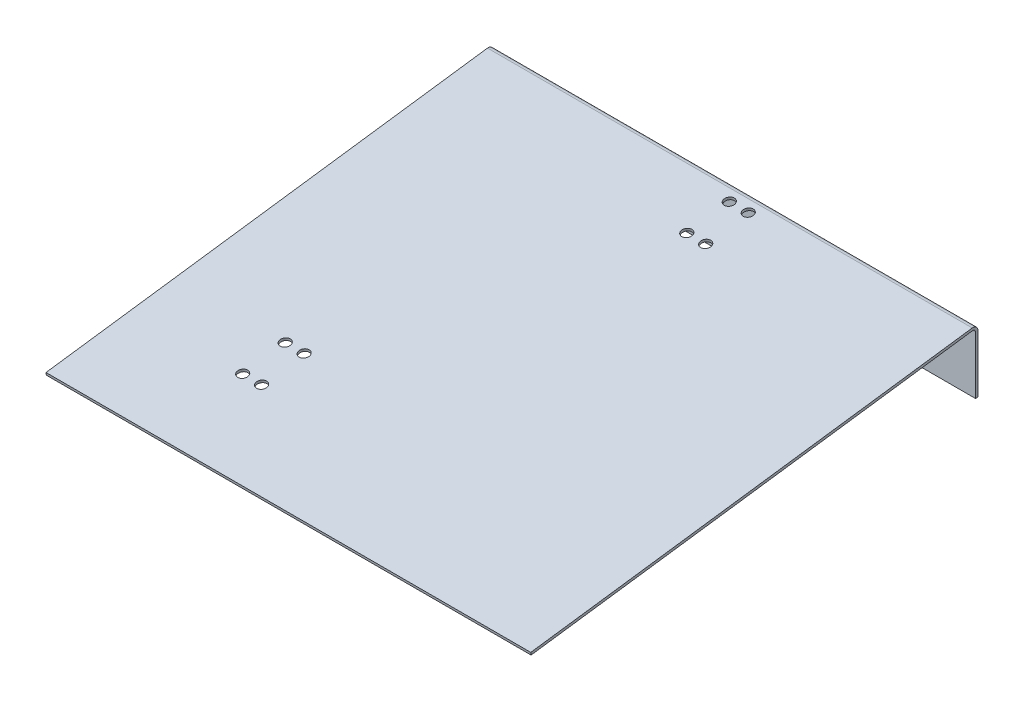
ISO-10303-21;
HEADER;
FILE_DESCRIPTION(('STEP AP214'),'2;1');
FILE_NAME('part.step','',(''),(''),'','','');
FILE_SCHEMA(('AUTOMOTIVE_DESIGN { 1 0 10303 214 1 1 1 1 }'));
ENDSEC;
DATA;
#1=APPLICATION_CONTEXT('core data for automotive mechanical design processes');
#2=APPLICATION_PROTOCOL_DEFINITION('international standard','automotive_design',2000,#1);
#3=PRODUCT_CONTEXT('',#1,'mechanical');
#4=PRODUCT('Part','Part','',(#3));
#5=PRODUCT_RELATED_PRODUCT_CATEGORY('part','',(#4));
#6=PRODUCT_DEFINITION_FORMATION('','',#4);
#7=PRODUCT_DEFINITION_CONTEXT('part definition',#1,'design');
#8=PRODUCT_DEFINITION('design','',#6,#7);
#9=PRODUCT_DEFINITION_SHAPE('','',#8);
#10=(LENGTH_UNIT() NAMED_UNIT(*) SI_UNIT(.MILLI.,.METRE.));
#11=(NAMED_UNIT(*) PLANE_ANGLE_UNIT() SI_UNIT($,.RADIAN.));
#12=(NAMED_UNIT(*) SI_UNIT($,.STERADIAN.) SOLID_ANGLE_UNIT());
#13=UNCERTAINTY_MEASURE_WITH_UNIT(LENGTH_MEASURE(1.E-05),#10,'distance_accuracy_value','');
#14=(GEOMETRIC_REPRESENTATION_CONTEXT(3) GLOBAL_UNCERTAINTY_ASSIGNED_CONTEXT((#13)) GLOBAL_UNIT_ASSIGNED_CONTEXT((#10,
#11,#12)) REPRESENTATION_CONTEXT('',''));
#15=CARTESIAN_POINT('',(0.,0.,0.));
#16=DIRECTION('',(0.,0.,1.));
#17=DIRECTION('',(1.,0.,0.));
#18=AXIS2_PLACEMENT_3D('',#15,#16,#17);
#19=CARTESIAN_POINT('',(304.8,76.2,-282.575));
#20=DIRECTION('',(0.,0.,1.));
#21=DIRECTION('',(1.,0.,0.));
#22=AXIS2_PLACEMENT_3D('',#19,#20,#21);
#23=PLANE('',#22);
#24=DIRECTION('',(0.,1.,0.));
#25=VECTOR('',#24,1.);
#26=CARTESIAN_POINT('',(-304.8,39.009334551279,-282.575));
#27=LINE('',#26,#25);
#28=CARTESIAN_POINT('',(-304.8,72.5626617948586,-282.575));
#29=VERTEX_POINT('',#28);
#30=CARTESIAN_POINT('',(-304.8,0.,-282.575));
#31=VERTEX_POINT('',#30);
#32=EDGE_CURVE('E63',#29,#31,#27,.F.);
#33=ORIENTED_EDGE('',*,*,#32,.F.);
#34=DIRECTION('',(1.,0.,0.));
#35=VECTOR('',#34,1.);
#36=CARTESIAN_POINT('',(304.8,72.5626617948586,-282.575));
#37=LINE('',#36,#35);
#38=CARTESIAN_POINT('',(304.8,72.5626617948586,-282.575));
#39=VERTEX_POINT('',#38);
#40=EDGE_CURVE('E84',#39,#29,#37,.F.);
#41=ORIENTED_EDGE('',*,*,#40,.F.);
#42=DIRECTION('',(0.,1.,0.));
#43=VECTOR('',#42,1.);
#44=CARTESIAN_POINT('',(304.8,39.009334551279,-282.575));
#45=LINE('',#44,#43);
#46=CARTESIAN_POINT('',(304.8,0.,-282.575));
#47=VERTEX_POINT('',#46);
#48=EDGE_CURVE('E83',#39,#47,#45,.F.);
#49=ORIENTED_EDGE('',*,*,#48,.T.);
#50=DIRECTION('',(1.,0.,0.));
#51=VECTOR('',#50,1.);
#52=CARTESIAN_POINT('',(0.,0.,-282.575));
#53=LINE('',#52,#51);
#54=EDGE_CURVE('E80',#47,#31,#53,.F.);
#55=ORIENTED_EDGE('',*,*,#54,.T.);
#56=EDGE_LOOP('',(#33,#41,#49,#55));
#57=FACE_BOUND('',#56,.T.);
#58=ADVANCED_FACE('F17',(#57),#23,.F.);
#59=CARTESIAN_POINT('',(0.,0.,-280.9875));
#60=DIRECTION('',(0.,1.,0.));
#61=DIRECTION('',(0.,0.,1.));
#62=AXIS2_PLACEMENT_3D('',#59,#60,#61);
#63=PLANE('',#62);
#64=ORIENTED_EDGE('',*,*,#54,.F.);
#65=DIRECTION('',(0.,0.,1.));
#66=VECTOR('',#65,1.);
#67=CARTESIAN_POINT('',(304.8,0.,-280.9875));
#68=LINE('',#67,#66);
#69=CARTESIAN_POINT('',(304.8,0.,-279.4));
#70=VERTEX_POINT('',#69);
#71=EDGE_CURVE('E72',#47,#70,#68,.T.);
#72=ORIENTED_EDGE('',*,*,#71,.T.);
#73=DIRECTION('',(1.,0.,0.));
#74=VECTOR('',#73,1.);
#75=CARTESIAN_POINT('',(304.8,0.,-279.4));
#76=LINE('',#75,#74);
#77=CARTESIAN_POINT('',(-304.8,0.,-279.4));
#78=VERTEX_POINT('',#77);
#79=EDGE_CURVE('E105',#78,#70,#76,.T.);
#80=ORIENTED_EDGE('',*,*,#79,.F.);
#81=DIRECTION('',(0.,0.,1.));
#82=VECTOR('',#81,1.);
#83=CARTESIAN_POINT('',(-304.8,0.,-280.9875));
#84=LINE('',#83,#82);
#85=EDGE_CURVE('E88',#31,#78,#84,.T.);
#86=ORIENTED_EDGE('',*,*,#85,.F.);
#87=EDGE_LOOP('',(#64,#72,#80,#86));
#88=FACE_BOUND('',#87,.T.);
#89=ADVANCED_FACE('F90',(#88),#63,.F.);
#90=CARTESIAN_POINT('',(304.8,72.5626617948586,-276.225));
#91=DIRECTION('',(1.,0.,0.));
#92=DIRECTION('',(0.,0.,-1.));
#93=AXIS2_PLACEMENT_3D('',#90,#91,#92);
#94=CYLINDRICAL_SURFACE('',#93,6.35);
#95=CARTESIAN_POINT('',(304.8,72.5626617948586,-276.225));
#96=DIRECTION('',(1.,0.,0.));
#97=DIRECTION('',(0.,0.,-1.));
#98=AXIS2_PLACEMENT_3D('',#95,#96,#97);
#99=CIRCLE('',#98,6.35);
#100=CARTESIAN_POINT('',(304.8,78.8544333619389,-275.367031149986));
#101=VERTEX_POINT('',#100);
#102=EDGE_CURVE('E165',#39,#101,#99,.T.);
#103=ORIENTED_EDGE('',*,*,#102,.F.);
#104=ORIENTED_EDGE('',*,*,#40,.T.);
#105=CARTESIAN_POINT('',(-304.8,72.5626617948586,-276.225));
#106=DIRECTION('',(1.,0.,0.));
#107=DIRECTION('',(0.,0.,-1.));
#108=AXIS2_PLACEMENT_3D('',#105,#106,#107);
#109=CIRCLE('',#108,6.35);
#110=CARTESIAN_POINT('',(-304.8,78.8544333619389,-275.367031149986));
#111=VERTEX_POINT('',#110);
#112=EDGE_CURVE('E20',#29,#111,#109,.T.);
#113=ORIENTED_EDGE('',*,*,#112,.T.);
#114=DIRECTION('',(1.,0.,0.));
#115=VECTOR('',#114,1.);
#116=CARTESIAN_POINT('',(304.8,78.854433361943,-275.367031150027));
#117=LINE('',#116,#115);
#118=EDGE_CURVE('E166',#111,#101,#117,.T.);
#119=ORIENTED_EDGE('',*,*,#118,.T.);
#120=EDGE_LOOP('',(#103,#104,#113,#119));
#121=FACE_BOUND('',#120,.T.);
#122=ADVANCED_FACE('F301',(#121),#94,.T.);
#123=CARTESIAN_POINT('',(304.8,76.2,-279.4));
#124=DIRECTION('',(0.,0.,1.));
#125=DIRECTION('',(1.,0.,0.));
#126=AXIS2_PLACEMENT_3D('',#123,#124,#125);
#127=PLANE('',#126);
#128=ORIENTED_EDGE('',*,*,#79,.T.);
#129=DIRECTION('',(0.,1.,0.));
#130=VECTOR('',#129,1.);
#131=CARTESIAN_POINT('',(304.8,76.2,-279.4));
#132=LINE('',#131,#130);
#133=CARTESIAN_POINT('',(304.8,72.5626617948586,-279.4));
#134=VERTEX_POINT('',#133);
#135=EDGE_CURVE('E94',#70,#134,#132,.T.);
#136=ORIENTED_EDGE('',*,*,#135,.T.);
#137=DIRECTION('',(1.,0.,0.));
#138=VECTOR('',#137,1.);
#139=CARTESIAN_POINT('',(304.8,72.5626617948586,-279.4));
#140=LINE('',#139,#138);
#141=CARTESIAN_POINT('',(-304.8,72.5626617948586,-279.4));
#142=VERTEX_POINT('',#141);
#143=EDGE_CURVE('E164',#134,#142,#140,.F.);
#144=ORIENTED_EDGE('',*,*,#143,.T.);
#145=DIRECTION('',(0.,1.,0.));
#146=VECTOR('',#145,1.);
#147=CARTESIAN_POINT('',(-304.8,76.2,-279.4));
#148=LINE('',#147,#146);
#149=EDGE_CURVE('E97',#142,#78,#148,.F.);
#150=ORIENTED_EDGE('',*,*,#149,.T.);
#151=EDGE_LOOP('',(#128,#136,#144,#150));
#152=FACE_BOUND('',#151,.T.);
#153=ADVANCED_FACE('F293',(#152),#127,.T.);
#154=CARTESIAN_POINT('',(304.8,3.1458857835397,279.828984424986));
#155=DIRECTION('',(0.,-0.990830168044301,-0.1351132047333));
#156=DIRECTION('',(0.,0.1351132047333,-0.990830168044301));
#157=AXIS2_PLACEMENT_3D('',#154,#155,#156);
#158=PLANE('',#157);
#159=CARTESIAN_POINT('',(-165.1,17.8232830057804,172.194738128606));
#160=DIRECTION('',(0.,-0.990830168044301,-0.1351132047333));
#161=DIRECTION('',(0.,0.1351132047333,-0.990830168044301));
#162=AXIS2_PLACEMENT_3D('',#159,#160,#161);
#163=CIRCLE('',#162,6.35);
#164=CARTESIAN_POINT('',(-165.1,18.6812518558369,165.902966561524));
#165=VERTEX_POINT('',#164);
#166=EDGE_CURVE('E135',#165,#165,#163,.T.);
#167=ORIENTED_EDGE('',*,*,#166,.T.);
#168=EDGE_LOOP('',(#167));
#169=FACE_BOUND('',#168,.T.);
#170=CARTESIAN_POINT('',(-165.1,25.1160182312537,118.714679808417));
#171=DIRECTION('',(0.,-0.990830168044301,-0.1351132047333));
#172=DIRECTION('',(0.,0.1351132047333,-0.990830168044301));
#173=AXIS2_PLACEMENT_3D('',#170,#171,#172);
#174=CIRCLE('',#173,6.35);
#175=CARTESIAN_POINT('',(-165.1,25.9739870813102,112.422908241336));
#176=VERTEX_POINT('',#175);
#177=EDGE_CURVE('E139',#176,#176,#174,.T.);
#178=ORIENTED_EDGE('',*,*,#177,.T.);
#179=EDGE_LOOP('',(#178));
#180=FACE_BOUND('',#179,.T.);
#181=CARTESIAN_POINT('',(-141.2875,17.8232830057804,172.194738128606));
#182=DIRECTION('',(0.,-0.990830168044301,-0.1351132047333));
#183=DIRECTION('',(0.,0.1351132047333,-0.990830168044301));
#184=AXIS2_PLACEMENT_3D('',#181,#182,#183);
#185=CIRCLE('',#184,6.35);
#186=CARTESIAN_POINT('',(-141.2875,18.6812518558369,165.902966561524));
#187=VERTEX_POINT('',#186);
#188=EDGE_CURVE('E142',#187,#187,#185,.T.);
#189=ORIENTED_EDGE('',*,*,#188,.T.);
#190=EDGE_LOOP('',(#189));
#191=FACE_BOUND('',#190,.T.);
#192=CARTESIAN_POINT('',(-141.2875,25.1160182312537,118.714679808417));
#193=DIRECTION('',(0.,-0.990830168044301,-0.1351132047333));
#194=DIRECTION('',(0.,0.1351132047333,-0.990830168044301));
#195=AXIS2_PLACEMENT_3D('',#192,#193,#194);
#196=CIRCLE('',#195,6.35);
#197=CARTESIAN_POINT('',(-141.2875,25.9739870813102,112.422908241336));
#198=VERTEX_POINT('',#197);
#199=EDGE_CURVE('E145',#198,#198,#196,.T.);
#200=ORIENTED_EDGE('',*,*,#199,.T.);
#201=EDGE_LOOP('',(#200));
#202=FACE_BOUND('',#201,.T.);
#203=CARTESIAN_POINT('',(36.5125,69.7303984341919,-208.457441679813));
#204=DIRECTION('',(0.,-0.990830168044301,-0.1351132047333));
#205=DIRECTION('',(0.,0.1351132047333,-0.990830168044301));
#206=AXIS2_PLACEMENT_3D('',#203,#204,#205);
#207=CIRCLE('',#206,6.35);
#208=CARTESIAN_POINT('',(36.5125,70.5883672842484,-214.749213246895));
#209=VERTEX_POINT('',#208);
#210=EDGE_CURVE('E148',#209,#209,#207,.T.);
#211=ORIENTED_EDGE('',*,*,#210,.T.);
#212=EDGE_LOOP('',(#211));
#213=FACE_BOUND('',#212,.T.);
#214=CARTESIAN_POINT('',(12.7,69.7303984341919,-208.457441679813));
#215=DIRECTION('',(0.,-0.990830168044301,-0.1351132047333));
#216=DIRECTION('',(0.,0.1351132047333,-0.990830168044301));
#217=AXIS2_PLACEMENT_3D('',#214,#215,#216);
#218=CIRCLE('',#217,6.35);
#219=CARTESIAN_POINT('',(12.7,70.5883672842484,-214.749213246895));
#220=VERTEX_POINT('',#219);
#221=EDGE_CURVE('E151',#220,#220,#218,.T.);
#222=ORIENTED_EDGE('',*,*,#221,.T.);
#223=EDGE_LOOP('',(#222));
#224=FACE_BOUND('',#223,.T.);
#225=CARTESIAN_POINT('',(36.5125,77.0231336596935,-261.937499999997));
#226=DIRECTION('',(0.,-0.990830168044301,-0.1351132047333));
#227=DIRECTION('',(0.,0.1351132047333,-0.990830168044301));
#228=AXIS2_PLACEMENT_3D('',#225,#226,#227);
#229=CIRCLE('',#228,6.35);
#230=CARTESIAN_POINT('',(36.5125,77.88110250975,-268.229271567079));
#231=VERTEX_POINT('',#230);
#232=EDGE_CURVE('E154',#231,#231,#229,.T.);
#233=ORIENTED_EDGE('',*,*,#232,.T.);
#234=EDGE_LOOP('',(#233));
#235=FACE_BOUND('',#234,.T.);
#236=CARTESIAN_POINT('',(12.7,77.0231336596935,-261.937499999997));
#237=DIRECTION('',(0.,-0.990830168044301,-0.1351132047333));
#238=DIRECTION('',(0.,0.1351132047333,-0.990830168044301));
#239=AXIS2_PLACEMENT_3D('',#236,#237,#238);
#240=CIRCLE('',#239,6.35);
#241=CARTESIAN_POINT('',(12.7,77.88110250975,-268.229271567079));
#242=VERTEX_POINT('',#241);
#243=EDGE_CURVE('E157',#242,#242,#240,.T.);
#244=ORIENTED_EDGE('',*,*,#243,.T.);
#245=EDGE_LOOP('',(#244));
#246=FACE_BOUND('',#245,.T.);
#247=DIRECTION('',(0.,0.135113204733291,-0.990830168044302));
#248=VECTOR('',#247,1.);
#249=CARTESIAN_POINT('',(-304.8,3.1458857835397,279.828984424986));
#250=LINE('',#249,#248);
#251=CARTESIAN_POINT('',(-304.8,3.1458857835331,279.828984425034));
#252=VERTEX_POINT('',#251);
#253=EDGE_CURVE('E188',#252,#111,#250,.T.);
#254=ORIENTED_EDGE('',*,*,#253,.F.);
#255=DIRECTION('',(1.,0.,0.));
#256=VECTOR('',#255,1.);
#257=CARTESIAN_POINT('',(0.,3.14588578351989,279.828984425131));
#258=LINE('',#257,#256);
#259=CARTESIAN_POINT('',(304.8,3.14588578352484,279.828984425095));
#260=VERTEX_POINT('',#259);
#261=EDGE_CURVE('E169',#260,#252,#258,.F.);
#262=ORIENTED_EDGE('',*,*,#261,.F.);
#263=DIRECTION('',(0.,0.135113204733291,-0.990830168044302));
#264=VECTOR('',#263,1.);
#265=CARTESIAN_POINT('',(304.8,3.1458857835397,279.828984424986));
#266=LINE('',#265,#264);
#267=EDGE_CURVE('E160',#260,#101,#266,.T.);
#268=ORIENTED_EDGE('',*,*,#267,.T.);
#269=ORIENTED_EDGE('',*,*,#118,.F.);
#270=EDGE_LOOP('',(#254,#262,#268,#269));
#271=FACE_BOUND('',#270,.T.);
#272=ADVANCED_FACE('F219',(#169,#180,#191,#202,#213,#224,#235,#246,#271),#158,.F.);
#273=CARTESIAN_POINT('',(0.,1.57294289177036,279.61449221262));
#274=DIRECTION('',(0.,-0.1351132047333,0.990830168044301));
#275=DIRECTION('',(0.,-0.990830168044301,-0.1351132047333));
#276=AXIS2_PLACEMENT_3D('',#273,#274,#275);
#277=PLANE('',#276);
#278=DIRECTION('',(0.,0.990830168046075,0.135113204720287));
#279=VECTOR('',#278,1.);
#280=CARTESIAN_POINT('',(-304.8,0.,279.4));
#281=LINE('',#280,#279);
#282=CARTESIAN_POINT('',(-304.8,-3.54694420614099E-12,279.400000000026));
#283=VERTEX_POINT('',#282);
#284=EDGE_CURVE('E191',#283,#252,#281,.T.);
#285=ORIENTED_EDGE('',*,*,#284,.F.);
#286=DIRECTION('',(1.,0.,0.));
#287=VECTOR('',#286,1.);
#288=CARTESIAN_POINT('',(304.8,0.,279.4));
#289=LINE('',#288,#287);
#290=CARTESIAN_POINT('',(304.8,-7.09388841159953E-12,279.400000000052));
#291=VERTEX_POINT('',#290);
#292=EDGE_CURVE('E138',#291,#283,#289,.F.);
#293=ORIENTED_EDGE('',*,*,#292,.F.);
#294=DIRECTION('',(0.,0.990830168046075,0.135113204720287));
#295=VECTOR('',#294,1.);
#296=CARTESIAN_POINT('',(304.8,0.,279.4));
#297=LINE('',#296,#295);
#298=EDGE_CURVE('E162',#291,#260,#297,.T.);
#299=ORIENTED_EDGE('',*,*,#298,.T.);
#300=ORIENTED_EDGE('',*,*,#261,.T.);
#301=EDGE_LOOP('',(#285,#293,#299,#300));
#302=FACE_BOUND('',#301,.T.);
#303=ADVANCED_FACE('F225',(#302),#277,.T.);
#304=CARTESIAN_POINT('',(-304.8,39.7958059971798,-0.686503893742832));
#305=DIRECTION('',(-1.,0.,0.));
#306=DIRECTION('',(0.,0.,1.));
#307=AXIS2_PLACEMENT_3D('',#304,#305,#306);
#308=PLANE('',#307);
#309=ORIENTED_EDGE('',*,*,#253,.T.);
#310=ORIENTED_EDGE('',*,*,#112,.F.);
#311=ORIENTED_EDGE('',*,*,#32,.T.);
#312=ORIENTED_EDGE('',*,*,#85,.T.);
#313=ORIENTED_EDGE('',*,*,#149,.F.);
#314=CARTESIAN_POINT('',(-304.8,72.5626617948586,-276.225));
#315=DIRECTION('',(1.,0.,0.));
#316=DIRECTION('',(0.,0.,-1.));
#317=AXIS2_PLACEMENT_3D('',#314,#315,#316);
#318=CIRCLE('',#317,3.175);
#319=CARTESIAN_POINT('',(-304.8,75.7085475784014,-275.796015574993));
#320=VERTEX_POINT('',#319);
#321=EDGE_CURVE('E163',#142,#320,#318,.T.);
#322=ORIENTED_EDGE('',*,*,#321,.T.);
#323=DIRECTION('',(0.,0.1351132047333,-0.990830168044301));
#324=VECTOR('',#323,1.);
#325=CARTESIAN_POINT('',(-304.8,0.,279.4));
#326=LINE('',#325,#324);
#327=EDGE_CURVE('E204',#283,#320,#326,.T.);
#328=ORIENTED_EDGE('',*,*,#327,.F.);
#329=ORIENTED_EDGE('',*,*,#284,.T.);
#330=EDGE_LOOP('',(#309,#310,#311,#312,#313,#322,#328,#329));
#331=FACE_BOUND('',#330,.T.);
#332=ADVANCED_FACE('F213',(#331),#308,.T.);
#333=CARTESIAN_POINT('',(304.8,72.5626617948586,-276.225));
#334=DIRECTION('',(1.,0.,0.));
#335=DIRECTION('',(0.,0.,-1.));
#336=AXIS2_PLACEMENT_3D('',#333,#334,#335);
#337=CYLINDRICAL_SURFACE('',#336,3.175);
#338=DIRECTION('',(1.,0.,0.));
#339=VECTOR('',#338,1.);
#340=CARTESIAN_POINT('',(304.8,75.7085475784035,-275.796015575015));
#341=LINE('',#340,#339);
#342=CARTESIAN_POINT('',(304.8,75.7085475784014,-275.796015574993));
#343=VERTEX_POINT('',#342);
#344=EDGE_CURVE('E231',#320,#343,#341,.T.);
#345=ORIENTED_EDGE('',*,*,#344,.F.);
#346=ORIENTED_EDGE('',*,*,#321,.F.);
#347=ORIENTED_EDGE('',*,*,#143,.F.);
#348=CARTESIAN_POINT('',(304.8,72.5626617948586,-276.225));
#349=DIRECTION('',(1.,0.,0.));
#350=DIRECTION('',(0.,0.,-1.));
#351=AXIS2_PLACEMENT_3D('',#348,#349,#350);
#352=CIRCLE('',#351,3.175);
#353=EDGE_CURVE('E35',#343,#134,#352,.F.);
#354=ORIENTED_EDGE('',*,*,#353,.F.);
#355=EDGE_LOOP('',(#345,#346,#347,#354));
#356=FACE_BOUND('',#355,.T.);
#357=ADVANCED_FACE('F237',(#356),#337,.F.);
#358=CARTESIAN_POINT('',(304.8,39.7958059971798,-0.686503893742832));
#359=DIRECTION('',(-1.,0.,0.));
#360=DIRECTION('',(0.,0.,1.));
#361=AXIS2_PLACEMENT_3D('',#358,#359,#360);
#362=PLANE('',#361);
#363=ORIENTED_EDGE('',*,*,#298,.F.);
#364=DIRECTION('',(0.,0.1351132047333,-0.990830168044301));
#365=VECTOR('',#364,1.);
#366=CARTESIAN_POINT('',(304.8,0.,279.4));
#367=LINE('',#366,#365);
#368=EDGE_CURVE('E134',#343,#291,#367,.F.);
#369=ORIENTED_EDGE('',*,*,#368,.F.);
#370=ORIENTED_EDGE('',*,*,#353,.T.);
#371=ORIENTED_EDGE('',*,*,#135,.F.);
#372=ORIENTED_EDGE('',*,*,#71,.F.);
#373=ORIENTED_EDGE('',*,*,#48,.F.);
#374=ORIENTED_EDGE('',*,*,#102,.T.);
#375=ORIENTED_EDGE('',*,*,#267,.F.);
#376=EDGE_LOOP('',(#363,#369,#370,#371,#372,#373,#374,#375));
#377=FACE_BOUND('',#376,.T.);
#378=ADVANCED_FACE('F93',(#377),#362,.F.);
#379=CARTESIAN_POINT('',(12.7,77.023133659673,-261.9375));
#380=DIRECTION('',(0.,-0.990830168044301,-0.1351132047333));
#381=DIRECTION('',(0.,0.1351132047333,-0.990830168044301));
#382=AXIS2_PLACEMENT_3D('',#379,#380,#381);
#383=CYLINDRICAL_SURFACE('',#382,6.35);
#384=ORIENTED_EDGE('',*,*,#243,.F.);
#385=EDGE_LOOP('',(#384));
#386=FACE_BOUND('',#385,.T.);
#387=CARTESIAN_POINT('',(12.7,73.877247876147,-262.366484425026));
#388=DIRECTION('',(0.,-0.990830168044301,-0.1351132047333));
#389=DIRECTION('',(0.,0.1351132047333,-0.990830168044301));
#390=AXIS2_PLACEMENT_3D('',#387,#388,#389);
#391=CIRCLE('',#390,6.35);
#392=CARTESIAN_POINT('',(12.7,74.7352167262034,-268.658255992108));
#393=VERTEX_POINT('',#392);
#394=EDGE_CURVE('E131',#393,#393,#391,.F.);
#395=ORIENTED_EDGE('',*,*,#394,.F.);
#396=EDGE_LOOP('',(#395));
#397=FACE_BOUND('',#396,.T.);
#398=ADVANCED_FACE('F245',(#386,#397),#383,.F.);
#399=CARTESIAN_POINT('',(36.5125,77.023133659673,-261.9375));
#400=DIRECTION('',(0.,-0.990830168044301,-0.1351132047333));
#401=DIRECTION('',(0.,0.1351132047333,-0.990830168044301));
#402=AXIS2_PLACEMENT_3D('',#399,#400,#401);
#403=CYLINDRICAL_SURFACE('',#402,6.35);
#404=ORIENTED_EDGE('',*,*,#232,.F.);
#405=EDGE_LOOP('',(#404));
#406=FACE_BOUND('',#405,.T.);
#407=CARTESIAN_POINT('',(36.5125,73.877247876147,-262.366484425026));
#408=DIRECTION('',(0.,-0.990830168044301,-0.1351132047333));
#409=DIRECTION('',(0.,0.1351132047333,-0.990830168044301));
#410=AXIS2_PLACEMENT_3D('',#407,#408,#409);
#411=CIRCLE('',#410,6.35);
#412=CARTESIAN_POINT('',(36.5125,74.7352167262034,-268.658255992108));
#413=VERTEX_POINT('',#412);
#414=EDGE_CURVE('E128',#413,#413,#411,.F.);
#415=ORIENTED_EDGE('',*,*,#414,.F.);
#416=EDGE_LOOP('',(#415));
#417=FACE_BOUND('',#416,.T.);
#418=ADVANCED_FACE('F278',(#406,#417),#403,.F.);
#419=CARTESIAN_POINT('',(12.7,69.7303984341998,-208.457441679812));
#420=DIRECTION('',(0.,-0.990830168044301,-0.1351132047333));
#421=DIRECTION('',(0.,0.1351132047333,-0.990830168044301));
#422=AXIS2_PLACEMENT_3D('',#419,#420,#421);
#423=CYLINDRICAL_SURFACE('',#422,6.35);
#424=ORIENTED_EDGE('',*,*,#221,.F.);
#425=EDGE_LOOP('',(#424));
#426=FACE_BOUND('',#425,.T.);
#427=CARTESIAN_POINT('',(12.7,66.5845126506635,-208.88642610484));
#428=DIRECTION('',(0.,-0.990830168044301,-0.1351132047333));
#429=DIRECTION('',(0.,0.1351132047333,-0.990830168044301));
#430=AXIS2_PLACEMENT_3D('',#427,#428,#429);
#431=CIRCLE('',#430,6.35);
#432=CARTESIAN_POINT('',(12.7,67.44248150072,-215.178197671921));
#433=VERTEX_POINT('',#432);
#434=EDGE_CURVE('E125',#433,#433,#431,.F.);
#435=ORIENTED_EDGE('',*,*,#434,.F.);
#436=EDGE_LOOP('',(#435));
#437=FACE_BOUND('',#436,.T.);
#438=ADVANCED_FACE('F274',(#426,#437),#423,.F.);
#439=CARTESIAN_POINT('',(36.5125,69.7303984341998,-208.457441679812));
#440=DIRECTION('',(0.,-0.990830168044301,-0.1351132047333));
#441=DIRECTION('',(0.,0.1351132047333,-0.990830168044301));
#442=AXIS2_PLACEMENT_3D('',#439,#440,#441);
#443=CYLINDRICAL_SURFACE('',#442,6.35);
#444=ORIENTED_EDGE('',*,*,#210,.F.);
#445=EDGE_LOOP('',(#444));
#446=FACE_BOUND('',#445,.T.);
#447=CARTESIAN_POINT('',(36.5125,66.5845126506635,-208.88642610484));
#448=DIRECTION('',(0.,-0.990830168044301,-0.1351132047333));
#449=DIRECTION('',(0.,0.1351132047333,-0.990830168044301));
#450=AXIS2_PLACEMENT_3D('',#447,#448,#449);
#451=CIRCLE('',#450,6.35);
#452=CARTESIAN_POINT('',(36.5125,67.44248150072,-215.178197671921));
#453=VERTEX_POINT('',#452);
#454=EDGE_CURVE('E122',#453,#453,#451,.F.);
#455=ORIENTED_EDGE('',*,*,#454,.F.);
#456=EDGE_LOOP('',(#455));
#457=FACE_BOUND('',#456,.T.);
#458=ADVANCED_FACE('F270',(#446,#457),#443,.F.);
#459=CARTESIAN_POINT('',(-141.2875,25.1160182312591,118.714679808418));
#460=DIRECTION('',(0.,-0.990830168044301,-0.1351132047333));
#461=DIRECTION('',(0.,0.1351132047333,-0.990830168044301));
#462=AXIS2_PLACEMENT_3D('',#459,#460,#461);
#463=CYLINDRICAL_SURFACE('',#462,6.35);
#464=ORIENTED_EDGE('',*,*,#199,.F.);
#465=EDGE_LOOP('',(#464));
#466=FACE_BOUND('',#465,.T.);
#467=CARTESIAN_POINT('',(-141.2875,21.9701324477178,118.28569538339));
#468=DIRECTION('',(0.,-0.990830168044301,-0.1351132047333));
#469=DIRECTION('',(0.,0.1351132047333,-0.990830168044301));
#470=AXIS2_PLACEMENT_3D('',#467,#468,#469);
#471=CIRCLE('',#470,6.35);
#472=CARTESIAN_POINT('',(-141.2875,22.8281012977743,111.993923816308));
#473=VERTEX_POINT('',#472);
#474=EDGE_CURVE('E119',#473,#473,#471,.F.);
#475=ORIENTED_EDGE('',*,*,#474,.F.);
#476=EDGE_LOOP('',(#475));
#477=FACE_BOUND('',#476,.T.);
#478=ADVANCED_FACE('F266',(#466,#477),#463,.F.);
#479=CARTESIAN_POINT('',(-141.2875,17.8232830057808,172.194738128606));
#480=DIRECTION('',(0.,-0.990830168044301,-0.1351132047333));
#481=DIRECTION('',(0.,0.1351132047333,-0.990830168044301));
#482=AXIS2_PLACEMENT_3D('',#479,#480,#481);
#483=CYLINDRICAL_SURFACE('',#482,6.35);
#484=ORIENTED_EDGE('',*,*,#188,.F.);
#485=EDGE_LOOP('',(#484));
#486=FACE_BOUND('',#485,.T.);
#487=CARTESIAN_POINT('',(-141.2875,14.6773972222371,171.765753703577));
#488=DIRECTION('',(0.,-0.990830168044301,-0.1351132047333));
#489=DIRECTION('',(0.,0.1351132047333,-0.990830168044301));
#490=AXIS2_PLACEMENT_3D('',#487,#488,#489);
#491=CIRCLE('',#490,6.35);
#492=CARTESIAN_POINT('',(-141.2875,15.5353660722935,165.473982136496));
#493=VERTEX_POINT('',#492);
#494=EDGE_CURVE('E116',#493,#493,#491,.F.);
#495=ORIENTED_EDGE('',*,*,#494,.F.);
#496=EDGE_LOOP('',(#495));
#497=FACE_BOUND('',#496,.T.);
#498=ADVANCED_FACE('F262',(#486,#497),#483,.F.);
#499=CARTESIAN_POINT('',(-165.1,25.1160182312591,118.714679808418));
#500=DIRECTION('',(0.,-0.990830168044301,-0.1351132047333));
#501=DIRECTION('',(0.,0.1351132047333,-0.990830168044301));
#502=AXIS2_PLACEMENT_3D('',#499,#500,#501);
#503=CYLINDRICAL_SURFACE('',#502,6.35);
#504=ORIENTED_EDGE('',*,*,#177,.F.);
#505=EDGE_LOOP('',(#504));
#506=FACE_BOUND('',#505,.T.);
#507=CARTESIAN_POINT('',(-165.1,21.9701324477178,118.28569538339));
#508=DIRECTION('',(0.,-0.990830168044301,-0.1351132047333));
#509=DIRECTION('',(0.,0.1351132047333,-0.990830168044301));
#510=AXIS2_PLACEMENT_3D('',#507,#508,#509);
#511=CIRCLE('',#510,6.35);
#512=CARTESIAN_POINT('',(-165.1,22.8281012977743,111.993923816308));
#513=VERTEX_POINT('',#512);
#514=EDGE_CURVE('E26',#513,#513,#511,.F.);
#515=ORIENTED_EDGE('',*,*,#514,.F.);
#516=EDGE_LOOP('',(#515));
#517=FACE_BOUND('',#516,.T.);
#518=ADVANCED_FACE('F255',(#506,#517),#503,.F.);
#519=CARTESIAN_POINT('',(-165.1,17.8232830057808,172.194738128606));
#520=DIRECTION('',(0.,-0.990830168044301,-0.1351132047333));
#521=DIRECTION('',(0.,0.1351132047333,-0.990830168044301));
#522=AXIS2_PLACEMENT_3D('',#519,#520,#521);
#523=CYLINDRICAL_SURFACE('',#522,6.35);
#524=ORIENTED_EDGE('',*,*,#166,.F.);
#525=EDGE_LOOP('',(#524));
#526=FACE_BOUND('',#525,.T.);
#527=CARTESIAN_POINT('',(-165.1,14.6773972222371,171.765753703577));
#528=DIRECTION('',(0.,-0.990830168044301,-0.1351132047333));
#529=DIRECTION('',(0.,0.1351132047333,-0.990830168044301));
#530=AXIS2_PLACEMENT_3D('',#527,#528,#529);
#531=CIRCLE('',#530,6.35);
#532=CARTESIAN_POINT('',(-165.1,15.5353660722935,165.473982136496));
#533=VERTEX_POINT('',#532);
#534=EDGE_CURVE('E11',#533,#533,#531,.F.);
#535=ORIENTED_EDGE('',*,*,#534,.F.);
#536=EDGE_LOOP('',(#535));
#537=FACE_BOUND('',#536,.T.);
#538=ADVANCED_FACE('F249',(#526,#537),#523,.F.);
#539=CARTESIAN_POINT('',(304.8,0.,279.4));
#540=DIRECTION('',(0.,-0.990830168044301,-0.1351132047333));
#541=DIRECTION('',(0.,0.1351132047333,-0.990830168044301));
#542=AXIS2_PLACEMENT_3D('',#539,#540,#541);
#543=PLANE('',#542);
#544=ORIENTED_EDGE('',*,*,#534,.T.);
#545=EDGE_LOOP('',(#544));
#546=FACE_BOUND('',#545,.T.);
#547=ORIENTED_EDGE('',*,*,#514,.T.);
#548=EDGE_LOOP('',(#547));
#549=FACE_BOUND('',#548,.T.);
#550=ORIENTED_EDGE('',*,*,#494,.T.);
#551=EDGE_LOOP('',(#550));
#552=FACE_BOUND('',#551,.T.);
#553=ORIENTED_EDGE('',*,*,#474,.T.);
#554=EDGE_LOOP('',(#553));
#555=FACE_BOUND('',#554,.T.);
#556=ORIENTED_EDGE('',*,*,#454,.T.);
#557=EDGE_LOOP('',(#556));
#558=FACE_BOUND('',#557,.T.);
#559=ORIENTED_EDGE('',*,*,#434,.T.);
#560=EDGE_LOOP('',(#559));
#561=FACE_BOUND('',#560,.T.);
#562=ORIENTED_EDGE('',*,*,#414,.T.);
#563=EDGE_LOOP('',(#562));
#564=FACE_BOUND('',#563,.T.);
#565=ORIENTED_EDGE('',*,*,#394,.T.);
#566=EDGE_LOOP('',(#565));
#567=FACE_BOUND('',#566,.T.);
#568=ORIENTED_EDGE('',*,*,#344,.T.);
#569=ORIENTED_EDGE('',*,*,#368,.T.);
#570=ORIENTED_EDGE('',*,*,#292,.T.);
#571=ORIENTED_EDGE('',*,*,#327,.T.);
#572=EDGE_LOOP('',(#568,#569,#570,#571));
#573=FACE_BOUND('',#572,.T.);
#574=ADVANCED_FACE('F230',(#546,#549,#552,#555,#558,#561,#564,#567,#573),#543,.T.);
#575=CLOSED_SHELL('',(#58,#89,#122,#153,#272,#303,#332,#357,#378,#398,#418,#438,#458,#478,#498,
#518,#538,#574));
#576=MANIFOLD_SOLID_BREP('B1',#575);
#577=ADVANCED_BREP_SHAPE_REPRESENTATION('',(#18,#576),#14);
#578=SHAPE_DEFINITION_REPRESENTATION(#9,#577);
ENDSEC;
END-ISO-10303-21;
